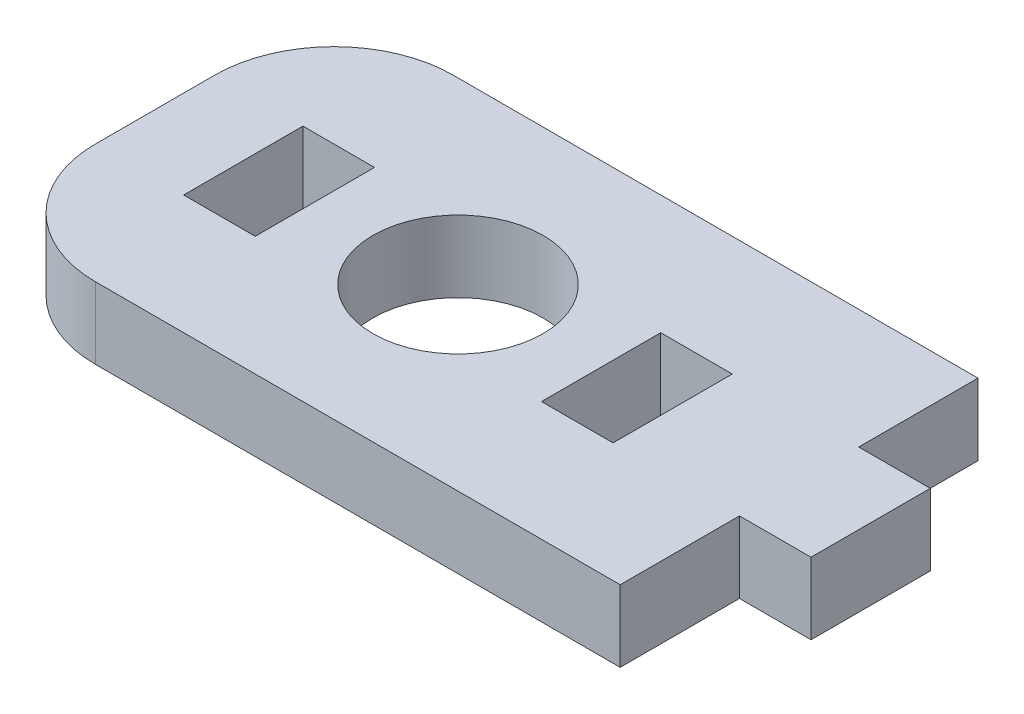
ISO-10303-21;
HEADER;
FILE_DESCRIPTION(('STEP AP214'),'2;1');
FILE_NAME('part.step','',(''),(''),'','','');
FILE_SCHEMA(('AUTOMOTIVE_DESIGN { 1 0 10303 214 1 1 1 1 }'));
ENDSEC;
DATA;
#1=APPLICATION_CONTEXT('core data for automotive mechanical design processes');
#2=APPLICATION_PROTOCOL_DEFINITION('international standard','automotive_design',2000,#1);
#3=PRODUCT_CONTEXT('',#1,'mechanical');
#4=PRODUCT('Part','Part','',(#3));
#5=PRODUCT_RELATED_PRODUCT_CATEGORY('part','',(#4));
#6=PRODUCT_DEFINITION_FORMATION('','',#4);
#7=PRODUCT_DEFINITION_CONTEXT('part definition',#1,'design');
#8=PRODUCT_DEFINITION('design','',#6,#7);
#9=PRODUCT_DEFINITION_SHAPE('','',#8);
#10=(LENGTH_UNIT() NAMED_UNIT(*) SI_UNIT(.MILLI.,.METRE.));
#11=(NAMED_UNIT(*) PLANE_ANGLE_UNIT() SI_UNIT($,.RADIAN.));
#12=(NAMED_UNIT(*) SI_UNIT($,.STERADIAN.) SOLID_ANGLE_UNIT());
#13=UNCERTAINTY_MEASURE_WITH_UNIT(LENGTH_MEASURE(1.E-05),#10,'distance_accuracy_value','');
#14=(GEOMETRIC_REPRESENTATION_CONTEXT(3) GLOBAL_UNCERTAINTY_ASSIGNED_CONTEXT((#13)) GLOBAL_UNIT_ASSIGNED_CONTEXT((#10,
#11,#12)) REPRESENTATION_CONTEXT('',''));
#15=CARTESIAN_POINT('',(0.,0.,0.));
#16=DIRECTION('',(0.,0.,1.));
#17=DIRECTION('',(1.,0.,0.));
#18=AXIS2_PLACEMENT_3D('',#15,#16,#17);
#19=CARTESIAN_POINT('',(0.,3.,0.));
#20=DIRECTION('',(0.,-1.,0.));
#21=DIRECTION('',(0.,0.,-1.));
#22=AXIS2_PLACEMENT_3D('',#19,#20,#21);
#23=PLANE('',#22);
#24=CARTESIAN_POINT('',(-9.12159290101671,3.,-2.5));
#25=DIRECTION('',(0.,1.,0.));
#26=DIRECTION('',(0.,0.,1.));
#27=AXIS2_PLACEMENT_3D('',#24,#25,#26);
#28=CIRCLE('',#27,3.5685);
#29=CARTESIAN_POINT('',(-9.12159290101671,3.,1.0685));
#30=VERTEX_POINT('',#29);
#31=EDGE_CURVE('E201',#30,#30,#28,.T.);
#32=ORIENTED_EDGE('',*,*,#31,.F.);
#33=EDGE_LOOP('',(#32));
#34=FACE_BOUND('',#33,.T.);
#35=DIRECTION('',(0.,0.,1.));
#36=VECTOR('',#35,1.);
#37=CARTESIAN_POINT('',(-21.8215929010167,3.,5.));
#38=LINE('',#37,#36);
#39=CARTESIAN_POINT('',(-21.8215929010167,3.,-5.));
#40=VERTEX_POINT('',#39);
#41=CARTESIAN_POINT('',(-21.8215929010167,3.,0.));
#42=VERTEX_POINT('',#41);
#43=EDGE_CURVE('E253',#40,#42,#38,.T.);
#44=ORIENTED_EDGE('',*,*,#43,.T.);
#45=CARTESIAN_POINT('',(-16.8215929010167,3.,0.));
#46=DIRECTION('',(0.,-1.,0.));
#47=DIRECTION('',(0.,0.,-1.));
#48=AXIS2_PLACEMENT_3D('',#45,#46,#47);
#49=CIRCLE('',#48,5.);
#50=CARTESIAN_POINT('',(-16.8215929010167,3.,5.));
#51=VERTEX_POINT('',#50);
#52=EDGE_CURVE('E40',#42,#51,#49,.F.);
#53=ORIENTED_EDGE('',*,*,#52,.T.);
#54=DIRECTION('',(1.,0.,0.));
#55=VECTOR('',#54,1.);
#56=CARTESIAN_POINT('',(5.17840709898329,3.,5.));
#57=LINE('',#56,#55);
#58=CARTESIAN_POINT('',(5.17840709898329,3.,5.));
#59=VERTEX_POINT('',#58);
#60=EDGE_CURVE('E238',#51,#59,#57,.T.);
#61=ORIENTED_EDGE('',*,*,#60,.T.);
#62=DIRECTION('',(0.,0.,-1.));
#63=VECTOR('',#62,1.);
#64=CARTESIAN_POINT('',(5.17840709898329,3.,0.));
#65=LINE('',#64,#63);
#66=CARTESIAN_POINT('',(5.17840709898329,3.,0.));
#67=VERTEX_POINT('',#66);
#68=EDGE_CURVE('E240',#59,#67,#65,.T.);
#69=ORIENTED_EDGE('',*,*,#68,.T.);
#70=DIRECTION('',(1.,0.,0.));
#71=VECTOR('',#70,1.);
#72=CARTESIAN_POINT('',(8.17840709898329,3.,0.));
#73=LINE('',#72,#71);
#74=CARTESIAN_POINT('',(8.17840709898329,3.,0.));
#75=VERTEX_POINT('',#74);
#76=EDGE_CURVE('E243',#67,#75,#73,.T.);
#77=ORIENTED_EDGE('',*,*,#76,.T.);
#78=DIRECTION('',(0.,0.,-1.));
#79=VECTOR('',#78,1.);
#80=CARTESIAN_POINT('',(8.17840709898329,3.,-5.));
#81=LINE('',#80,#79);
#82=CARTESIAN_POINT('',(8.17840709898329,3.,-5.));
#83=VERTEX_POINT('',#82);
#84=EDGE_CURVE('E245',#75,#83,#81,.T.);
#85=ORIENTED_EDGE('',*,*,#84,.T.);
#86=DIRECTION('',(-1.,0.,0.));
#87=VECTOR('',#86,1.);
#88=CARTESIAN_POINT('',(5.17840709898329,3.,-5.));
#89=LINE('',#88,#87);
#90=CARTESIAN_POINT('',(5.17840709898329,3.,-5.));
#91=VERTEX_POINT('',#90);
#92=EDGE_CURVE('E247',#83,#91,#89,.T.);
#93=ORIENTED_EDGE('',*,*,#92,.T.);
#94=DIRECTION('',(0.,0.,-1.));
#95=VECTOR('',#94,1.);
#96=CARTESIAN_POINT('',(5.17840709898329,3.,-10.));
#97=LINE('',#96,#95);
#98=CARTESIAN_POINT('',(5.17840709898329,3.,-10.));
#99=VERTEX_POINT('',#98);
#100=EDGE_CURVE('E249',#91,#99,#97,.T.);
#101=ORIENTED_EDGE('',*,*,#100,.T.);
#102=DIRECTION('',(-1.,0.,0.));
#103=VECTOR('',#102,1.);
#104=CARTESIAN_POINT('',(-21.8215929010167,3.,-10.));
#105=LINE('',#104,#103);
#106=CARTESIAN_POINT('',(-16.8215929010167,3.,-10.));
#107=VERTEX_POINT('',#106);
#108=EDGE_CURVE('E251',#99,#107,#105,.T.);
#109=ORIENTED_EDGE('',*,*,#108,.T.);
#110=CARTESIAN_POINT('',(-16.8215929010167,3.,-5.));
#111=DIRECTION('',(0.,-1.,0.));
#112=DIRECTION('',(0.,0.,-1.));
#113=AXIS2_PLACEMENT_3D('',#110,#111,#112);
#114=CIRCLE('',#113,5.);
#115=EDGE_CURVE('E298',#107,#40,#114,.F.);
#116=ORIENTED_EDGE('',*,*,#115,.T.);
#117=EDGE_LOOP('',(#44,#53,#61,#69,#77,#85,#93,#101,#109,#116));
#118=FACE_BOUND('',#117,.T.);
#119=DIRECTION('',(0.,0.,1.));
#120=VECTOR('',#119,1.);
#121=CARTESIAN_POINT('',(-18.1215929010167,3.,-5.));
#122=LINE('',#121,#120);
#123=CARTESIAN_POINT('',(-18.1215929010167,3.,-5.));
#124=VERTEX_POINT('',#123);
#125=CARTESIAN_POINT('',(-18.1215929010167,3.,0.));
#126=VERTEX_POINT('',#125);
#127=EDGE_CURVE('E207',#124,#126,#122,.T.);
#128=ORIENTED_EDGE('',*,*,#127,.F.);
#129=DIRECTION('',(-1.,0.,0.));
#130=VECTOR('',#129,1.);
#131=CARTESIAN_POINT('',(-15.1215929010167,3.,-5.));
#132=LINE('',#131,#130);
#133=CARTESIAN_POINT('',(-15.1215929010167,3.,-5.));
#134=VERTEX_POINT('',#133);
#135=EDGE_CURVE('E215',#134,#124,#132,.T.);
#136=ORIENTED_EDGE('',*,*,#135,.F.);
#137=DIRECTION('',(0.,0.,-1.));
#138=VECTOR('',#137,1.);
#139=CARTESIAN_POINT('',(-15.1215929010167,3.,-5.));
#140=LINE('',#139,#138);
#141=CARTESIAN_POINT('',(-15.1215929010167,3.,0.));
#142=VERTEX_POINT('',#141);
#143=EDGE_CURVE('E212',#142,#134,#140,.T.);
#144=ORIENTED_EDGE('',*,*,#143,.F.);
#145=DIRECTION('',(1.,0.,0.));
#146=VECTOR('',#145,1.);
#147=CARTESIAN_POINT('',(-15.1215929010167,3.,0.));
#148=LINE('',#147,#146);
#149=EDGE_CURVE('E209',#126,#142,#148,.T.);
#150=ORIENTED_EDGE('',*,*,#149,.F.);
#151=EDGE_LOOP('',(#128,#136,#144,#150));
#152=FACE_BOUND('',#151,.T.);
#153=DIRECTION('',(0.,0.,1.));
#154=VECTOR('',#153,1.);
#155=CARTESIAN_POINT('',(-3.12159290101671,3.,-5.));
#156=LINE('',#155,#154);
#157=CARTESIAN_POINT('',(-3.12159290101671,3.,-5.));
#158=VERTEX_POINT('',#157);
#159=CARTESIAN_POINT('',(-3.12159290101671,3.,0.));
#160=VERTEX_POINT('',#159);
#161=EDGE_CURVE('E160',#158,#160,#156,.T.);
#162=ORIENTED_EDGE('',*,*,#161,.F.);
#163=DIRECTION('',(-1.,0.,0.));
#164=VECTOR('',#163,1.);
#165=CARTESIAN_POINT('',(-3.12159290101671,3.,-5.));
#166=LINE('',#165,#164);
#167=CARTESIAN_POINT('',(-0.121592901016709,3.,-5.));
#168=VERTEX_POINT('',#167);
#169=EDGE_CURVE('E185',#168,#158,#166,.T.);
#170=ORIENTED_EDGE('',*,*,#169,.F.);
#171=DIRECTION('',(0.,0.,-1.));
#172=VECTOR('',#171,1.);
#173=CARTESIAN_POINT('',(-0.121592901016709,3.,-5.));
#174=LINE('',#173,#172);
#175=CARTESIAN_POINT('',(-0.121592901016709,3.,0.));
#176=VERTEX_POINT('',#175);
#177=EDGE_CURVE('E183',#176,#168,#174,.T.);
#178=ORIENTED_EDGE('',*,*,#177,.F.);
#179=DIRECTION('',(1.,0.,0.));
#180=VECTOR('',#179,1.);
#181=CARTESIAN_POINT('',(-3.12159290101671,3.,0.));
#182=LINE('',#181,#180);
#183=EDGE_CURVE('E170',#160,#176,#182,.T.);
#184=ORIENTED_EDGE('',*,*,#183,.F.);
#185=EDGE_LOOP('',(#162,#170,#178,#184));
#186=FACE_BOUND('',#185,.T.);
#187=ADVANCED_FACE('F32',(#34,#118,#152,#186),#23,.F.);
#188=CARTESIAN_POINT('',(0.,0.,0.));
#189=DIRECTION('',(0.,-1.,0.));
#190=DIRECTION('',(0.,0.,-1.));
#191=AXIS2_PLACEMENT_3D('',#188,#189,#190);
#192=PLANE('',#191);
#193=CARTESIAN_POINT('',(-9.12159290101671,0.,-2.5));
#194=DIRECTION('',(0.,1.,0.));
#195=DIRECTION('',(0.,0.,1.));
#196=AXIS2_PLACEMENT_3D('',#193,#194,#195);
#197=CIRCLE('',#196,3.5685);
#198=CARTESIAN_POINT('',(-9.12159290101671,0.,1.0685));
#199=VERTEX_POINT('',#198);
#200=EDGE_CURVE('E178',#199,#199,#197,.T.);
#201=ORIENTED_EDGE('',*,*,#200,.T.);
#202=EDGE_LOOP('',(#201));
#203=FACE_BOUND('',#202,.T.);
#204=DIRECTION('',(1.,0.,0.));
#205=VECTOR('',#204,1.);
#206=CARTESIAN_POINT('',(5.17840709898329,0.,5.));
#207=LINE('',#206,#205);
#208=CARTESIAN_POINT('',(-16.8215929010167,0.,5.));
#209=VERTEX_POINT('',#208);
#210=CARTESIAN_POINT('',(5.17840709898329,0.,5.));
#211=VERTEX_POINT('',#210);
#212=EDGE_CURVE('E237',#209,#211,#207,.T.);
#213=ORIENTED_EDGE('',*,*,#212,.F.);
#214=CARTESIAN_POINT('',(-16.8215929010167,0.,0.));
#215=DIRECTION('',(0.,-1.,0.));
#216=DIRECTION('',(0.,0.,-1.));
#217=AXIS2_PLACEMENT_3D('',#214,#215,#216);
#218=CIRCLE('',#217,5.);
#219=CARTESIAN_POINT('',(-21.8215929010167,0.,0.));
#220=VERTEX_POINT('',#219);
#221=EDGE_CURVE('E292',#209,#220,#218,.T.);
#222=ORIENTED_EDGE('',*,*,#221,.T.);
#223=DIRECTION('',(0.,0.,1.));
#224=VECTOR('',#223,1.);
#225=CARTESIAN_POINT('',(-21.8215929010167,0.,5.));
#226=LINE('',#225,#224);
#227=CARTESIAN_POINT('',(-21.8215929010167,0.,-5.));
#228=VERTEX_POINT('',#227);
#229=EDGE_CURVE('E241',#228,#220,#226,.T.);
#230=ORIENTED_EDGE('',*,*,#229,.F.);
#231=CARTESIAN_POINT('',(-16.8215929010167,0.,-5.));
#232=DIRECTION('',(0.,-1.,0.));
#233=DIRECTION('',(0.,0.,-1.));
#234=AXIS2_PLACEMENT_3D('',#231,#232,#233);
#235=CIRCLE('',#234,5.);
#236=CARTESIAN_POINT('',(-16.8215929010167,0.,-10.));
#237=VERTEX_POINT('',#236);
#238=EDGE_CURVE('E290',#228,#237,#235,.T.);
#239=ORIENTED_EDGE('',*,*,#238,.T.);
#240=DIRECTION('',(-1.,0.,0.));
#241=VECTOR('',#240,1.);
#242=CARTESIAN_POINT('',(-21.8215929010167,0.,-10.));
#243=LINE('',#242,#241);
#244=CARTESIAN_POINT('',(5.17840709898329,0.,-10.));
#245=VERTEX_POINT('',#244);
#246=EDGE_CURVE('E267',#245,#237,#243,.T.);
#247=ORIENTED_EDGE('',*,*,#246,.F.);
#248=DIRECTION('',(0.,0.,-1.));
#249=VECTOR('',#248,1.);
#250=CARTESIAN_POINT('',(5.17840709898329,0.,-10.));
#251=LINE('',#250,#249);
#252=CARTESIAN_POINT('',(5.17840709898329,0.,-5.));
#253=VERTEX_POINT('',#252);
#254=EDGE_CURVE('E265',#253,#245,#251,.T.);
#255=ORIENTED_EDGE('',*,*,#254,.F.);
#256=DIRECTION('',(-1.,0.,0.));
#257=VECTOR('',#256,1.);
#258=CARTESIAN_POINT('',(5.17840709898329,0.,-5.));
#259=LINE('',#258,#257);
#260=CARTESIAN_POINT('',(8.17840709898329,0.,-5.));
#261=VERTEX_POINT('',#260);
#262=EDGE_CURVE('E263',#261,#253,#259,.T.);
#263=ORIENTED_EDGE('',*,*,#262,.F.);
#264=DIRECTION('',(0.,0.,-1.));
#265=VECTOR('',#264,1.);
#266=CARTESIAN_POINT('',(8.17840709898329,0.,-5.));
#267=LINE('',#266,#265);
#268=CARTESIAN_POINT('',(8.17840709898329,0.,0.));
#269=VERTEX_POINT('',#268);
#270=EDGE_CURVE('E261',#269,#261,#267,.T.);
#271=ORIENTED_EDGE('',*,*,#270,.F.);
#272=DIRECTION('',(1.,0.,0.));
#273=VECTOR('',#272,1.);
#274=CARTESIAN_POINT('',(8.17840709898329,0.,0.));
#275=LINE('',#274,#273);
#276=CARTESIAN_POINT('',(5.17840709898329,0.,0.));
#277=VERTEX_POINT('',#276);
#278=EDGE_CURVE('E259',#277,#269,#275,.T.);
#279=ORIENTED_EDGE('',*,*,#278,.F.);
#280=DIRECTION('',(0.,0.,-1.));
#281=VECTOR('',#280,1.);
#282=CARTESIAN_POINT('',(5.17840709898329,0.,0.));
#283=LINE('',#282,#281);
#284=EDGE_CURVE('E257',#211,#277,#283,.T.);
#285=ORIENTED_EDGE('',*,*,#284,.F.);
#286=EDGE_LOOP('',(#213,#222,#230,#239,#247,#255,#263,#271,#279,#285));
#287=FACE_BOUND('',#286,.T.);
#288=DIRECTION('',(-1.,0.,0.));
#289=VECTOR('',#288,1.);
#290=CARTESIAN_POINT('',(-15.1215929010167,0.,-5.));
#291=LINE('',#290,#289);
#292=CARTESIAN_POINT('',(-15.1215929010167,0.,-5.));
#293=VERTEX_POINT('',#292);
#294=CARTESIAN_POINT('',(-18.1215929010167,0.,-5.));
#295=VERTEX_POINT('',#294);
#296=EDGE_CURVE('E210',#293,#295,#291,.T.);
#297=ORIENTED_EDGE('',*,*,#296,.T.);
#298=DIRECTION('',(0.,0.,1.));
#299=VECTOR('',#298,1.);
#300=CARTESIAN_POINT('',(-18.1215929010167,0.,-5.));
#301=LINE('',#300,#299);
#302=CARTESIAN_POINT('',(-18.1215929010167,0.,0.));
#303=VERTEX_POINT('',#302);
#304=EDGE_CURVE('E204',#295,#303,#301,.T.);
#305=ORIENTED_EDGE('',*,*,#304,.T.);
#306=DIRECTION('',(1.,0.,0.));
#307=VECTOR('',#306,1.);
#308=CARTESIAN_POINT('',(-15.1215929010167,0.,0.));
#309=LINE('',#308,#307);
#310=CARTESIAN_POINT('',(-15.1215929010167,0.,0.));
#311=VERTEX_POINT('',#310);
#312=EDGE_CURVE('E220',#303,#311,#309,.T.);
#313=ORIENTED_EDGE('',*,*,#312,.T.);
#314=DIRECTION('',(0.,0.,-1.));
#315=VECTOR('',#314,1.);
#316=CARTESIAN_POINT('',(-15.1215929010167,0.,-5.));
#317=LINE('',#316,#315);
#318=EDGE_CURVE('E223',#311,#293,#317,.T.);
#319=ORIENTED_EDGE('',*,*,#318,.T.);
#320=EDGE_LOOP('',(#297,#305,#313,#319));
#321=FACE_BOUND('',#320,.T.);
#322=DIRECTION('',(-1.,0.,0.));
#323=VECTOR('',#322,1.);
#324=CARTESIAN_POINT('',(-3.12159290101671,0.,-5.));
#325=LINE('',#324,#323);
#326=CARTESIAN_POINT('',(-0.121592901016709,0.,-5.));
#327=VERTEX_POINT('',#326);
#328=CARTESIAN_POINT('',(-3.12159290101671,0.,-5.));
#329=VERTEX_POINT('',#328);
#330=EDGE_CURVE('E171',#327,#329,#325,.T.);
#331=ORIENTED_EDGE('',*,*,#330,.T.);
#332=DIRECTION('',(0.,0.,1.));
#333=VECTOR('',#332,1.);
#334=CARTESIAN_POINT('',(-3.12159290101671,0.,-5.));
#335=LINE('',#334,#333);
#336=CARTESIAN_POINT('',(-3.12159290101671,0.,0.));
#337=VERTEX_POINT('',#336);
#338=EDGE_CURVE('E189',#329,#337,#335,.T.);
#339=ORIENTED_EDGE('',*,*,#338,.T.);
#340=DIRECTION('',(1.,0.,0.));
#341=VECTOR('',#340,1.);
#342=CARTESIAN_POINT('',(-3.12159290101671,0.,0.));
#343=LINE('',#342,#341);
#344=CARTESIAN_POINT('',(-0.121592901016709,0.,0.));
#345=VERTEX_POINT('',#344);
#346=EDGE_CURVE('E177',#337,#345,#343,.T.);
#347=ORIENTED_EDGE('',*,*,#346,.T.);
#348=DIRECTION('',(0.,0.,-1.));
#349=VECTOR('',#348,1.);
#350=CARTESIAN_POINT('',(-0.121592901016709,0.,-5.));
#351=LINE('',#350,#349);
#352=EDGE_CURVE('E192',#345,#327,#351,.T.);
#353=ORIENTED_EDGE('',*,*,#352,.T.);
#354=EDGE_LOOP('',(#331,#339,#347,#353));
#355=FACE_BOUND('',#354,.T.);
#356=ADVANCED_FACE('F313',(#203,#287,#321,#355),#192,.T.);
#357=CARTESIAN_POINT('',(5.17840709898329,3.,5.));
#358=DIRECTION('',(0.,0.,-1.));
#359=DIRECTION('',(-1.,0.,0.));
#360=AXIS2_PLACEMENT_3D('',#357,#358,#359);
#361=PLANE('',#360);
#362=ORIENTED_EDGE('',*,*,#60,.F.);
#363=DIRECTION('',(0.,-1.,0.));
#364=VECTOR('',#363,1.);
#365=CARTESIAN_POINT('',(-16.8215929010167,3.,5.));
#366=LINE('',#365,#364);
#367=EDGE_CURVE('E287',#51,#209,#366,.T.);
#368=ORIENTED_EDGE('',*,*,#367,.T.);
#369=ORIENTED_EDGE('',*,*,#212,.T.);
#370=DIRECTION('',(0.,-1.,0.));
#371=VECTOR('',#370,1.);
#372=CARTESIAN_POINT('',(5.17840709898329,3.,5.));
#373=LINE('',#372,#371);
#374=EDGE_CURVE('E284',#59,#211,#373,.T.);
#375=ORIENTED_EDGE('',*,*,#374,.F.);
#376=EDGE_LOOP('',(#362,#368,#369,#375));
#377=FACE_BOUND('',#376,.T.);
#378=ADVANCED_FACE('F308',(#377),#361,.F.);
#379=CARTESIAN_POINT('',(5.17840709898329,3.,0.));
#380=DIRECTION('',(-1.,0.,0.));
#381=DIRECTION('',(0.,0.,1.));
#382=AXIS2_PLACEMENT_3D('',#379,#380,#381);
#383=PLANE('',#382);
#384=ORIENTED_EDGE('',*,*,#284,.T.);
#385=DIRECTION('',(0.,-1.,0.));
#386=VECTOR('',#385,1.);
#387=CARTESIAN_POINT('',(5.17840709898329,3.,0.));
#388=LINE('',#387,#386);
#389=EDGE_CURVE('E281',#67,#277,#388,.T.);
#390=ORIENTED_EDGE('',*,*,#389,.F.);
#391=ORIENTED_EDGE('',*,*,#68,.F.);
#392=ORIENTED_EDGE('',*,*,#374,.T.);
#393=EDGE_LOOP('',(#384,#390,#391,#392));
#394=FACE_BOUND('',#393,.T.);
#395=ADVANCED_FACE('F344',(#394),#383,.F.);
#396=CARTESIAN_POINT('',(8.17840709898329,3.,0.));
#397=DIRECTION('',(0.,0.,-1.));
#398=DIRECTION('',(-1.,0.,0.));
#399=AXIS2_PLACEMENT_3D('',#396,#397,#398);
#400=PLANE('',#399);
#401=ORIENTED_EDGE('',*,*,#278,.T.);
#402=DIRECTION('',(0.,-1.,0.));
#403=VECTOR('',#402,1.);
#404=CARTESIAN_POINT('',(8.17840709898329,3.,0.));
#405=LINE('',#404,#403);
#406=EDGE_CURVE('E278',#75,#269,#405,.T.);
#407=ORIENTED_EDGE('',*,*,#406,.F.);
#408=ORIENTED_EDGE('',*,*,#76,.F.);
#409=ORIENTED_EDGE('',*,*,#389,.T.);
#410=EDGE_LOOP('',(#401,#407,#408,#409));
#411=FACE_BOUND('',#410,.T.);
#412=ADVANCED_FACE('F341',(#411),#400,.F.);
#413=CARTESIAN_POINT('',(8.17840709898329,3.,-5.));
#414=DIRECTION('',(-1.,0.,0.));
#415=DIRECTION('',(0.,0.,1.));
#416=AXIS2_PLACEMENT_3D('',#413,#414,#415);
#417=PLANE('',#416);
#418=ORIENTED_EDGE('',*,*,#270,.T.);
#419=DIRECTION('',(0.,-1.,0.));
#420=VECTOR('',#419,1.);
#421=CARTESIAN_POINT('',(8.17840709898329,3.,-5.));
#422=LINE('',#421,#420);
#423=EDGE_CURVE('E275',#83,#261,#422,.T.);
#424=ORIENTED_EDGE('',*,*,#423,.F.);
#425=ORIENTED_EDGE('',*,*,#84,.F.);
#426=ORIENTED_EDGE('',*,*,#406,.T.);
#427=EDGE_LOOP('',(#418,#424,#425,#426));
#428=FACE_BOUND('',#427,.T.);
#429=ADVANCED_FACE('F337',(#428),#417,.F.);
#430=CARTESIAN_POINT('',(5.17840709898329,3.,-5.));
#431=DIRECTION('',(0.,0.,1.));
#432=DIRECTION('',(1.,0.,0.));
#433=AXIS2_PLACEMENT_3D('',#430,#431,#432);
#434=PLANE('',#433);
#435=ORIENTED_EDGE('',*,*,#262,.T.);
#436=DIRECTION('',(0.,-1.,0.));
#437=VECTOR('',#436,1.);
#438=CARTESIAN_POINT('',(5.17840709898329,3.,-5.));
#439=LINE('',#438,#437);
#440=EDGE_CURVE('E272',#91,#253,#439,.T.);
#441=ORIENTED_EDGE('',*,*,#440,.F.);
#442=ORIENTED_EDGE('',*,*,#92,.F.);
#443=ORIENTED_EDGE('',*,*,#423,.T.);
#444=EDGE_LOOP('',(#435,#441,#442,#443));
#445=FACE_BOUND('',#444,.T.);
#446=ADVANCED_FACE('F332',(#445),#434,.F.);
#447=CARTESIAN_POINT('',(5.17840709898329,3.,-10.));
#448=DIRECTION('',(-1.,0.,0.));
#449=DIRECTION('',(0.,0.,1.));
#450=AXIS2_PLACEMENT_3D('',#447,#448,#449);
#451=PLANE('',#450);
#452=ORIENTED_EDGE('',*,*,#254,.T.);
#453=DIRECTION('',(0.,-1.,0.));
#454=VECTOR('',#453,1.);
#455=CARTESIAN_POINT('',(5.17840709898329,3.,-10.));
#456=LINE('',#455,#454);
#457=EDGE_CURVE('E255',#99,#245,#456,.T.);
#458=ORIENTED_EDGE('',*,*,#457,.F.);
#459=ORIENTED_EDGE('',*,*,#100,.F.);
#460=ORIENTED_EDGE('',*,*,#440,.T.);
#461=EDGE_LOOP('',(#452,#458,#459,#460));
#462=FACE_BOUND('',#461,.T.);
#463=ADVANCED_FACE('F326',(#462),#451,.F.);
#464=CARTESIAN_POINT('',(-21.8215929010167,3.,-10.));
#465=DIRECTION('',(0.,0.,1.));
#466=DIRECTION('',(1.,0.,0.));
#467=AXIS2_PLACEMENT_3D('',#464,#465,#466);
#468=PLANE('',#467);
#469=ORIENTED_EDGE('',*,*,#246,.T.);
#470=DIRECTION('',(0.,-1.,0.));
#471=VECTOR('',#470,1.);
#472=CARTESIAN_POINT('',(-16.8215929010167,3.,-10.));
#473=LINE('',#472,#471);
#474=EDGE_CURVE('E11',#237,#107,#473,.F.);
#475=ORIENTED_EDGE('',*,*,#474,.T.);
#476=ORIENTED_EDGE('',*,*,#108,.F.);
#477=ORIENTED_EDGE('',*,*,#457,.T.);
#478=EDGE_LOOP('',(#469,#475,#476,#477));
#479=FACE_BOUND('',#478,.T.);
#480=ADVANCED_FACE('F322',(#479),#468,.F.);
#481=CARTESIAN_POINT('',(-21.8215929010167,3.,5.));
#482=DIRECTION('',(1.,0.,0.));
#483=DIRECTION('',(0.,0.,-1.));
#484=AXIS2_PLACEMENT_3D('',#481,#482,#483);
#485=PLANE('',#484);
#486=ORIENTED_EDGE('',*,*,#229,.T.);
#487=DIRECTION('',(0.,-1.,0.));
#488=VECTOR('',#487,1.);
#489=CARTESIAN_POINT('',(-21.8215929010167,3.,0.));
#490=LINE('',#489,#488);
#491=EDGE_CURVE('E53',#220,#42,#490,.F.);
#492=ORIENTED_EDGE('',*,*,#491,.T.);
#493=ORIENTED_EDGE('',*,*,#43,.F.);
#494=DIRECTION('',(0.,-1.,0.));
#495=VECTOR('',#494,1.);
#496=CARTESIAN_POINT('',(-21.8215929010167,3.,-5.));
#497=LINE('',#496,#495);
#498=EDGE_CURVE('E294',#40,#228,#497,.T.);
#499=ORIENTED_EDGE('',*,*,#498,.T.);
#500=EDGE_LOOP('',(#486,#492,#493,#499));
#501=FACE_BOUND('',#500,.T.);
#502=ADVANCED_FACE('F316',(#501),#485,.F.);
#503=CARTESIAN_POINT('',(-18.1215929010167,3.,-5.));
#504=DIRECTION('',(1.,0.,0.));
#505=DIRECTION('',(0.,0.,-1.));
#506=AXIS2_PLACEMENT_3D('',#503,#504,#505);
#507=PLANE('',#506);
#508=ORIENTED_EDGE('',*,*,#304,.F.);
#509=DIRECTION('',(0.,-1.,0.));
#510=VECTOR('',#509,1.);
#511=CARTESIAN_POINT('',(-18.1215929010167,3.,-5.));
#512=LINE('',#511,#510);
#513=EDGE_CURVE('E217',#124,#295,#512,.T.);
#514=ORIENTED_EDGE('',*,*,#513,.F.);
#515=ORIENTED_EDGE('',*,*,#127,.T.);
#516=DIRECTION('',(0.,-1.,0.));
#517=VECTOR('',#516,1.);
#518=CARTESIAN_POINT('',(-18.1215929010167,3.,0.));
#519=LINE('',#518,#517);
#520=EDGE_CURVE('E234',#126,#303,#519,.T.);
#521=ORIENTED_EDGE('',*,*,#520,.T.);
#522=EDGE_LOOP('',(#508,#514,#515,#521));
#523=FACE_BOUND('',#522,.T.);
#524=ADVANCED_FACE('F363',(#523),#507,.T.);
#525=CARTESIAN_POINT('',(-15.1215929010167,3.,0.));
#526=DIRECTION('',(0.,0.,-1.));
#527=DIRECTION('',(-1.,0.,0.));
#528=AXIS2_PLACEMENT_3D('',#525,#526,#527);
#529=PLANE('',#528);
#530=ORIENTED_EDGE('',*,*,#312,.F.);
#531=ORIENTED_EDGE('',*,*,#520,.F.);
#532=ORIENTED_EDGE('',*,*,#149,.T.);
#533=DIRECTION('',(0.,-1.,0.));
#534=VECTOR('',#533,1.);
#535=CARTESIAN_POINT('',(-15.1215929010167,3.,0.));
#536=LINE('',#535,#534);
#537=EDGE_CURVE('E232',#142,#311,#536,.T.);
#538=ORIENTED_EDGE('',*,*,#537,.T.);
#539=EDGE_LOOP('',(#530,#531,#532,#538));
#540=FACE_BOUND('',#539,.T.);
#541=ADVANCED_FACE('F403',(#540),#529,.T.);
#542=CARTESIAN_POINT('',(-15.1215929010167,3.,-5.));
#543=DIRECTION('',(-1.,0.,0.));
#544=DIRECTION('',(0.,0.,1.));
#545=AXIS2_PLACEMENT_3D('',#542,#543,#544);
#546=PLANE('',#545);
#547=ORIENTED_EDGE('',*,*,#318,.F.);
#548=ORIENTED_EDGE('',*,*,#537,.F.);
#549=ORIENTED_EDGE('',*,*,#143,.T.);
#550=DIRECTION('',(0.,-1.,0.));
#551=VECTOR('',#550,1.);
#552=CARTESIAN_POINT('',(-15.1215929010167,3.,-5.));
#553=LINE('',#552,#551);
#554=EDGE_CURVE('E230',#134,#293,#553,.T.);
#555=ORIENTED_EDGE('',*,*,#554,.T.);
#556=EDGE_LOOP('',(#547,#548,#549,#555));
#557=FACE_BOUND('',#556,.T.);
#558=ADVANCED_FACE('F410',(#557),#546,.T.);
#559=CARTESIAN_POINT('',(-15.1215929010167,3.,-5.));
#560=DIRECTION('',(0.,0.,1.));
#561=DIRECTION('',(1.,0.,0.));
#562=AXIS2_PLACEMENT_3D('',#559,#560,#561);
#563=PLANE('',#562);
#564=ORIENTED_EDGE('',*,*,#296,.F.);
#565=ORIENTED_EDGE('',*,*,#554,.F.);
#566=ORIENTED_EDGE('',*,*,#135,.T.);
#567=ORIENTED_EDGE('',*,*,#513,.T.);
#568=EDGE_LOOP('',(#564,#565,#566,#567));
#569=FACE_BOUND('',#568,.T.);
#570=ADVANCED_FACE('F417',(#569),#563,.T.);
#571=CARTESIAN_POINT('',(-9.12159290101671,3.,-2.5));
#572=DIRECTION('',(0.,-1.,0.));
#573=DIRECTION('',(0.,0.,-1.));
#574=AXIS2_PLACEMENT_3D('',#571,#572,#573);
#575=CYLINDRICAL_SURFACE('',#574,3.5685);
#576=ORIENTED_EDGE('',*,*,#31,.T.);
#577=EDGE_LOOP('',(#576));
#578=FACE_BOUND('',#577,.T.);
#579=ORIENTED_EDGE('',*,*,#200,.F.);
#580=EDGE_LOOP('',(#579));
#581=FACE_BOUND('',#580,.T.);
#582=ADVANCED_FACE('F425',(#578,#581),#575,.F.);
#583=CARTESIAN_POINT('',(-3.12159290101671,3.,-5.));
#584=DIRECTION('',(1.,0.,0.));
#585=DIRECTION('',(0.,0.,-1.));
#586=AXIS2_PLACEMENT_3D('',#583,#584,#585);
#587=PLANE('',#586);
#588=ORIENTED_EDGE('',*,*,#338,.F.);
#589=DIRECTION('',(0.,-1.,0.));
#590=VECTOR('',#589,1.);
#591=CARTESIAN_POINT('',(-3.12159290101671,3.,-5.));
#592=LINE('',#591,#590);
#593=EDGE_CURVE('E166',#158,#329,#592,.T.);
#594=ORIENTED_EDGE('',*,*,#593,.F.);
#595=ORIENTED_EDGE('',*,*,#161,.T.);
#596=DIRECTION('',(0.,-1.,0.));
#597=VECTOR('',#596,1.);
#598=CARTESIAN_POINT('',(-3.12159290101671,3.,0.));
#599=LINE('',#598,#597);
#600=EDGE_CURVE('E163',#160,#337,#599,.T.);
#601=ORIENTED_EDGE('',*,*,#600,.T.);
#602=EDGE_LOOP('',(#588,#594,#595,#601));
#603=FACE_BOUND('',#602,.T.);
#604=ADVANCED_FACE('F162',(#603),#587,.T.);
#605=CARTESIAN_POINT('',(-3.12159290101671,3.,0.));
#606=DIRECTION('',(0.,0.,-1.));
#607=DIRECTION('',(-1.,0.,0.));
#608=AXIS2_PLACEMENT_3D('',#605,#606,#607);
#609=PLANE('',#608);
#610=ORIENTED_EDGE('',*,*,#346,.F.);
#611=ORIENTED_EDGE('',*,*,#600,.F.);
#612=ORIENTED_EDGE('',*,*,#183,.T.);
#613=DIRECTION('',(0.,-1.,0.));
#614=VECTOR('',#613,1.);
#615=CARTESIAN_POINT('',(-0.121592901016709,3.,0.));
#616=LINE('',#615,#614);
#617=EDGE_CURVE('E179',#176,#345,#616,.T.);
#618=ORIENTED_EDGE('',*,*,#617,.T.);
#619=EDGE_LOOP('',(#610,#611,#612,#618));
#620=FACE_BOUND('',#619,.T.);
#621=ADVANCED_FACE('F174',(#620),#609,.T.);
#622=CARTESIAN_POINT('',(-0.121592901016709,3.,-5.));
#623=DIRECTION('',(-1.,0.,0.));
#624=DIRECTION('',(0.,0.,1.));
#625=AXIS2_PLACEMENT_3D('',#622,#623,#624);
#626=PLANE('',#625);
#627=ORIENTED_EDGE('',*,*,#352,.F.);
#628=ORIENTED_EDGE('',*,*,#617,.F.);
#629=ORIENTED_EDGE('',*,*,#177,.T.);
#630=DIRECTION('',(0.,-1.,0.));
#631=VECTOR('',#630,1.);
#632=CARTESIAN_POINT('',(-0.121592901016709,3.,-5.));
#633=LINE('',#632,#631);
#634=EDGE_CURVE('E198',#168,#327,#633,.T.);
#635=ORIENTED_EDGE('',*,*,#634,.T.);
#636=EDGE_LOOP('',(#627,#628,#629,#635));
#637=FACE_BOUND('',#636,.T.);
#638=ADVANCED_FACE('F446',(#637),#626,.T.);
#639=CARTESIAN_POINT('',(-3.12159290101671,3.,-5.));
#640=DIRECTION('',(0.,0.,1.));
#641=DIRECTION('',(1.,0.,0.));
#642=AXIS2_PLACEMENT_3D('',#639,#640,#641);
#643=PLANE('',#642);
#644=ORIENTED_EDGE('',*,*,#330,.F.);
#645=ORIENTED_EDGE('',*,*,#634,.F.);
#646=ORIENTED_EDGE('',*,*,#169,.T.);
#647=ORIENTED_EDGE('',*,*,#593,.T.);
#648=EDGE_LOOP('',(#644,#645,#646,#647));
#649=FACE_BOUND('',#648,.T.);
#650=ADVANCED_FACE('F453',(#649),#643,.T.);
#651=CARTESIAN_POINT('',(-16.8215929010167,3.,0.));
#652=DIRECTION('',(0.,-1.,0.));
#653=DIRECTION('',(0.,0.,-1.));
#654=AXIS2_PLACEMENT_3D('',#651,#652,#653);
#655=CYLINDRICAL_SURFACE('',#654,5.);
#656=ORIENTED_EDGE('',*,*,#52,.F.);
#657=ORIENTED_EDGE('',*,*,#491,.F.);
#658=ORIENTED_EDGE('',*,*,#221,.F.);
#659=ORIENTED_EDGE('',*,*,#367,.F.);
#660=EDGE_LOOP('',(#656,#657,#658,#659));
#661=FACE_BOUND('',#660,.T.);
#662=ADVANCED_FACE('F310',(#661),#655,.T.);
#663=CARTESIAN_POINT('',(-16.8215929010167,3.,-5.));
#664=DIRECTION('',(0.,-1.,0.));
#665=DIRECTION('',(0.,0.,-1.));
#666=AXIS2_PLACEMENT_3D('',#663,#664,#665);
#667=CYLINDRICAL_SURFACE('',#666,5.);
#668=ORIENTED_EDGE('',*,*,#115,.F.);
#669=ORIENTED_EDGE('',*,*,#474,.F.);
#670=ORIENTED_EDGE('',*,*,#238,.F.);
#671=ORIENTED_EDGE('',*,*,#498,.F.);
#672=EDGE_LOOP('',(#668,#669,#670,#671));
#673=FACE_BOUND('',#672,.T.);
#674=ADVANCED_FACE('F34',(#673),#667,.T.);
#675=CLOSED_SHELL('',(#187,#356,#378,#395,#412,#429,#446,#463,#480,#502,#524,#541,#558,#570,
#582,#604,#621,#638,#650,#662,#674));
#676=MANIFOLD_SOLID_BREP('B2',#675);
#677=ADVANCED_BREP_SHAPE_REPRESENTATION('',(#18,#676),#14);
#678=SHAPE_DEFINITION_REPRESENTATION(#9,#677);
ENDSEC;
END-ISO-10303-21;
